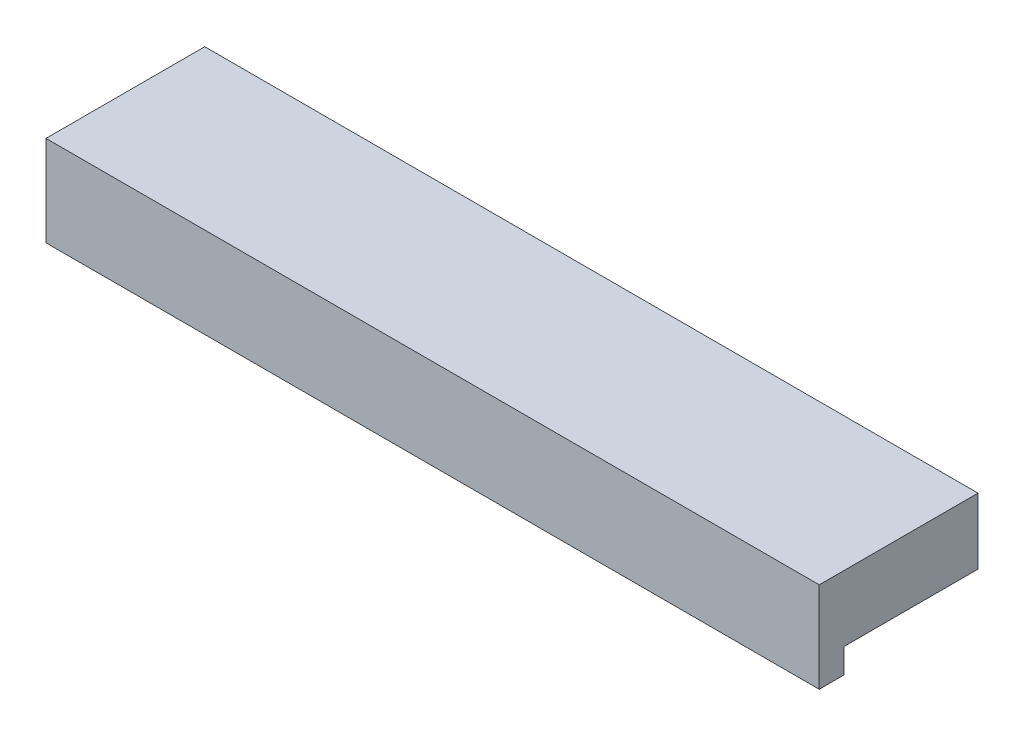
ISO-10303-21;
HEADER;
FILE_DESCRIPTION(('STEP AP214'),'2;1');
FILE_NAME('part.step','',(''),(''),'','','');
FILE_SCHEMA(('AUTOMOTIVE_DESIGN { 1 0 10303 214 1 1 1 1 }'));
ENDSEC;
DATA;
#1=APPLICATION_CONTEXT('core data for automotive mechanical design processes');
#2=APPLICATION_PROTOCOL_DEFINITION('international standard','automotive_design',2000,#1);
#3=PRODUCT_CONTEXT('',#1,'mechanical');
#4=PRODUCT('Part','Part','',(#3));
#5=PRODUCT_RELATED_PRODUCT_CATEGORY('part','',(#4));
#6=PRODUCT_DEFINITION_FORMATION('','',#4);
#7=PRODUCT_DEFINITION_CONTEXT('part definition',#1,'design');
#8=PRODUCT_DEFINITION('design','',#6,#7);
#9=PRODUCT_DEFINITION_SHAPE('','',#8);
#10=(LENGTH_UNIT() NAMED_UNIT(*) SI_UNIT(.MILLI.,.METRE.));
#11=(NAMED_UNIT(*) PLANE_ANGLE_UNIT() SI_UNIT($,.RADIAN.));
#12=(NAMED_UNIT(*) SI_UNIT($,.STERADIAN.) SOLID_ANGLE_UNIT());
#13=UNCERTAINTY_MEASURE_WITH_UNIT(LENGTH_MEASURE(1.E-05),#10,'distance_accuracy_value','');
#14=(GEOMETRIC_REPRESENTATION_CONTEXT(3) GLOBAL_UNCERTAINTY_ASSIGNED_CONTEXT((#13)) GLOBAL_UNIT_ASSIGNED_CONTEXT((#10,
#11,#12)) REPRESENTATION_CONTEXT('',''));
#15=CARTESIAN_POINT('',(0.,0.,0.));
#16=DIRECTION('',(0.,0.,1.));
#17=DIRECTION('',(1.,0.,0.));
#18=AXIS2_PLACEMENT_3D('',#15,#16,#17);
#19=CARTESIAN_POINT('',(-146.083399220501,-24.7311663924978,-18.5004782565443));
#20=DIRECTION('',(0.,-1.,0.));
#21=DIRECTION('',(1.,0.,0.));
#22=AXIS2_PLACEMENT_3D('',#19,#20,#21);
#23=PLANE('',#22);
#24=DIRECTION('',(-1.,0.,0.));
#25=VECTOR('',#24,1.);
#26=CARTESIAN_POINT('',(28.0832674461654,-24.7311663924978,-18.5004782565443));
#27=LINE('',#26,#25);
#28=CARTESIAN_POINT('',(10.5832674461654,-24.7311663924978,-18.5004782565443));
#29=VERTEX_POINT('',#28);
#30=CARTESIAN_POINT('',(-146.083399220501,-24.7311663924978,-18.5004782565443));
#31=VERTEX_POINT('',#30);
#32=EDGE_CURVE('E11',#29,#31,#27,.T.);
#33=ORIENTED_EDGE('',*,*,#32,.T.);
#34=DIRECTION('',(0.,0.,1.));
#35=VECTOR('',#34,1.);
#36=CARTESIAN_POINT('',(-146.083399220501,-24.7311663924978,4.33149354715814));
#37=LINE('',#36,#35);
#38=CARTESIAN_POINT('',(-146.083399220501,-24.7311663924978,13.6648268804915));
#39=VERTEX_POINT('',#38);
#40=EDGE_CURVE('E50',#31,#39,#37,.T.);
#41=ORIENTED_EDGE('',*,*,#40,.T.);
#42=DIRECTION('',(-1.,0.,0.));
#43=VECTOR('',#42,1.);
#44=CARTESIAN_POINT('',(45.1666007794988,-24.7311663924978,13.6648268804915));
#45=LINE('',#44,#43);
#46=CARTESIAN_POINT('',(10.5832674461654,-24.7311663924978,13.6648268804915));
#47=VERTEX_POINT('',#46);
#48=EDGE_CURVE('E136',#47,#39,#45,.T.);
#49=ORIENTED_EDGE('',*,*,#48,.F.);
#50=DIRECTION('',(0.,0.,-1.));
#51=VECTOR('',#50,1.);
#52=CARTESIAN_POINT('',(10.5832674461654,-24.7311663924978,4.33149354715814));
#53=LINE('',#52,#51);
#54=EDGE_CURVE('E45',#47,#29,#53,.T.);
#55=ORIENTED_EDGE('',*,*,#54,.T.);
#56=EDGE_LOOP('',(#33,#41,#49,#55));
#57=FACE_BOUND('',#56,.T.);
#58=ADVANCED_FACE('F42',(#57),#23,.F.);
#59=CARTESIAN_POINT('',(10.5832674461654,-43.0644997258311,4.33149354715814));
#60=DIRECTION('',(1.,0.,0.));
#61=DIRECTION('',(0.,-1.,0.));
#62=AXIS2_PLACEMENT_3D('',#59,#60,#61);
#63=PLANE('',#62);
#64=ORIENTED_EDGE('',*,*,#54,.F.);
#65=DIRECTION('',(0.,1.,0.));
#66=VECTOR('',#65,1.);
#67=CARTESIAN_POINT('',(10.5832674461654,-43.0644997258311,13.6648268804915));
#68=LINE('',#67,#66);
#69=CARTESIAN_POINT('',(10.5832674461654,-43.0644997258311,13.6648268804915));
#70=VERTEX_POINT('',#69);
#71=EDGE_CURVE('E122',#70,#47,#68,.T.);
#72=ORIENTED_EDGE('',*,*,#71,.F.);
#73=DIRECTION('',(0.,0.,-1.));
#74=VECTOR('',#73,1.);
#75=CARTESIAN_POINT('',(10.5832674461654,-43.0644997258312,12.6648268804915));
#76=LINE('',#75,#74);
#77=CARTESIAN_POINT('',(10.5832674461654,-43.0644997258311,8.66482688049147));
#78=VERTEX_POINT('',#77);
#79=EDGE_CURVE('E113',#70,#78,#76,.T.);
#80=ORIENTED_EDGE('',*,*,#79,.T.);
#81=DIRECTION('',(0.,-1.,0.));
#82=VECTOR('',#81,1.);
#83=CARTESIAN_POINT('',(10.5832674461654,-43.0644997258311,8.66482688049147));
#84=LINE('',#83,#82);
#85=CARTESIAN_POINT('',(10.5832674461654,-38.0644997258311,8.66482688049147));
#86=VERTEX_POINT('',#85);
#87=EDGE_CURVE('E117',#86,#78,#84,.T.);
#88=ORIENTED_EDGE('',*,*,#87,.F.);
#89=DIRECTION('',(0.,0.,1.));
#90=VECTOR('',#89,1.);
#91=CARTESIAN_POINT('',(10.5832674461654,-38.0644997258311,8.66482688049147));
#92=LINE('',#91,#90);
#93=CARTESIAN_POINT('',(10.5832674461654,-38.0644997258312,-18.5004782565443));
#94=VERTEX_POINT('',#93);
#95=EDGE_CURVE('E100',#94,#86,#92,.T.);
#96=ORIENTED_EDGE('',*,*,#95,.F.);
#97=DIRECTION('',(0.,1.,0.));
#98=VECTOR('',#97,1.);
#99=CARTESIAN_POINT('',(10.5832674461654,-43.0644997258313,-18.5004782565443));
#100=LINE('',#99,#98);
#101=EDGE_CURVE('E110',#94,#29,#100,.T.);
#102=ORIENTED_EDGE('',*,*,#101,.T.);
#103=EDGE_LOOP('',(#64,#72,#80,#88,#96,#102));
#104=FACE_BOUND('',#103,.T.);
#105=ADVANCED_FACE('F115',(#104),#63,.T.);
#106=CARTESIAN_POINT('',(45.1666007794988,-43.0644997258311,13.6648268804915));
#107=DIRECTION('',(0.,0.,-1.));
#108=DIRECTION('',(0.,-1.,0.));
#109=AXIS2_PLACEMENT_3D('',#106,#107,#108);
#110=PLANE('',#109);
#111=ORIENTED_EDGE('',*,*,#71,.T.);
#112=ORIENTED_EDGE('',*,*,#48,.T.);
#113=DIRECTION('',(0.,-1.,0.));
#114=VECTOR('',#113,1.);
#115=CARTESIAN_POINT('',(-146.083399220501,-43.0644997258312,13.6648268804915));
#116=LINE('',#115,#114);
#117=CARTESIAN_POINT('',(-146.083399220501,-43.0644997258311,13.6648268804915));
#118=VERTEX_POINT('',#117);
#119=EDGE_CURVE('E106',#39,#118,#116,.T.);
#120=ORIENTED_EDGE('',*,*,#119,.T.);
#121=DIRECTION('',(1.,0.,0.));
#122=VECTOR('',#121,1.);
#123=CARTESIAN_POINT('',(40.1666007794988,-43.0644997258311,13.6648268804915));
#124=LINE('',#123,#122);
#125=EDGE_CURVE('E120',#118,#70,#124,.T.);
#126=ORIENTED_EDGE('',*,*,#125,.T.);
#127=EDGE_LOOP('',(#111,#112,#120,#126));
#128=FACE_BOUND('',#127,.T.);
#129=ADVANCED_FACE('F142',(#128),#110,.F.);
#130=CARTESIAN_POINT('',(45.1666007794988,-43.0644997258311,12.6648268804915));
#131=DIRECTION('',(0.,-1.,0.));
#132=DIRECTION('',(0.,0.,-1.));
#133=AXIS2_PLACEMENT_3D('',#130,#131,#132);
#134=PLANE('',#133);
#135=DIRECTION('',(0.,0.,1.));
#136=VECTOR('',#135,1.);
#137=CARTESIAN_POINT('',(-146.083399220501,-43.0644997258312,12.6648268804915));
#138=LINE('',#137,#136);
#139=CARTESIAN_POINT('',(-146.083399220501,-43.0644997258311,8.66482688049147));
#140=VERTEX_POINT('',#139);
#141=EDGE_CURVE('E133',#140,#118,#138,.T.);
#142=ORIENTED_EDGE('',*,*,#141,.F.);
#143=DIRECTION('',(-1.,0.,0.));
#144=VECTOR('',#143,1.);
#145=CARTESIAN_POINT('',(40.1666007794988,-43.0644997258311,8.66482688049147));
#146=LINE('',#145,#144);
#147=EDGE_CURVE('E107',#78,#140,#146,.T.);
#148=ORIENTED_EDGE('',*,*,#147,.F.);
#149=ORIENTED_EDGE('',*,*,#79,.F.);
#150=ORIENTED_EDGE('',*,*,#125,.F.);
#151=EDGE_LOOP('',(#142,#148,#149,#150));
#152=FACE_BOUND('',#151,.T.);
#153=ADVANCED_FACE('F150',(#152),#134,.T.);
#154=CARTESIAN_POINT('',(45.1666007794988,-43.0644997258311,8.66482688049147));
#155=DIRECTION('',(0.,0.,1.));
#156=DIRECTION('',(1.,0.,0.));
#157=AXIS2_PLACEMENT_3D('',#154,#155,#156);
#158=PLANE('',#157);
#159=ORIENTED_EDGE('',*,*,#147,.T.);
#160=DIRECTION('',(0.,1.,0.));
#161=VECTOR('',#160,1.);
#162=CARTESIAN_POINT('',(-146.083399220501,-43.0644997258312,8.66482688049147));
#163=LINE('',#162,#161);
#164=CARTESIAN_POINT('',(-146.083399220501,-38.0644997258311,8.66482688049147));
#165=VERTEX_POINT('',#164);
#166=EDGE_CURVE('E132',#140,#165,#163,.T.);
#167=ORIENTED_EDGE('',*,*,#166,.T.);
#168=DIRECTION('',(1.,0.,0.));
#169=VECTOR('',#168,1.);
#170=CARTESIAN_POINT('',(40.1666007794988,-38.0644997258311,8.66482688049147));
#171=LINE('',#170,#169);
#172=EDGE_CURVE('E118',#165,#86,#171,.T.);
#173=ORIENTED_EDGE('',*,*,#172,.T.);
#174=ORIENTED_EDGE('',*,*,#87,.T.);
#175=EDGE_LOOP('',(#159,#167,#173,#174));
#176=FACE_BOUND('',#175,.T.);
#177=ADVANCED_FACE('F152',(#176),#158,.F.);
#178=CARTESIAN_POINT('',(40.1666007794988,-38.0644997258311,8.66482688049147));
#179=DIRECTION('',(0.,1.,0.));
#180=DIRECTION('',(1.,0.,0.));
#181=AXIS2_PLACEMENT_3D('',#178,#179,#180);
#182=PLANE('',#181);
#183=ORIENTED_EDGE('',*,*,#172,.F.);
#184=DIRECTION('',(0.,0.,-1.));
#185=VECTOR('',#184,1.);
#186=CARTESIAN_POINT('',(-146.083399220501,-38.0644997258311,8.66482688049147));
#187=LINE('',#186,#185);
#188=CARTESIAN_POINT('',(-146.083399220501,-38.0644997258315,-18.5004782565443));
#189=VERTEX_POINT('',#188);
#190=EDGE_CURVE('E103',#165,#189,#187,.T.);
#191=ORIENTED_EDGE('',*,*,#190,.T.);
#192=DIRECTION('',(1.,0.,0.));
#193=VECTOR('',#192,1.);
#194=CARTESIAN_POINT('',(-67.7500658871679,-38.0644997258313,-18.5004782565443));
#195=LINE('',#194,#193);
#196=EDGE_CURVE('E95',#189,#94,#195,.T.);
#197=ORIENTED_EDGE('',*,*,#196,.T.);
#198=ORIENTED_EDGE('',*,*,#95,.T.);
#199=EDGE_LOOP('',(#183,#191,#197,#198));
#200=FACE_BOUND('',#199,.T.);
#201=ADVANCED_FACE('F98',(#200),#182,.F.);
#202=CARTESIAN_POINT('',(-67.7500658871679,-43.0644997258313,-18.5004782565443));
#203=DIRECTION('',(0.,0.,-1.));
#204=DIRECTION('',(0.,-1.,0.));
#205=AXIS2_PLACEMENT_3D('',#202,#203,#204);
#206=PLANE('',#205);
#207=DIRECTION('',(0.,-1.,0.));
#208=VECTOR('',#207,1.);
#209=CARTESIAN_POINT('',(-146.083399220501,-43.0644997258313,-18.5004782565443));
#210=LINE('',#209,#208);
#211=EDGE_CURVE('E137',#31,#189,#210,.T.);
#212=ORIENTED_EDGE('',*,*,#211,.F.);
#213=ORIENTED_EDGE('',*,*,#32,.F.);
#214=ORIENTED_EDGE('',*,*,#101,.F.);
#215=ORIENTED_EDGE('',*,*,#196,.F.);
#216=EDGE_LOOP('',(#212,#213,#214,#215));
#217=FACE_BOUND('',#216,.T.);
#218=ADVANCED_FACE('F111',(#217),#206,.T.);
#219=CARTESIAN_POINT('',(-146.083399220501,-43.0644997258311,4.33149354715814));
#220=DIRECTION('',(-1.,0.,0.));
#221=DIRECTION('',(0.,1.,0.));
#222=AXIS2_PLACEMENT_3D('',#219,#220,#221);
#223=PLANE('',#222);
#224=ORIENTED_EDGE('',*,*,#40,.F.);
#225=ORIENTED_EDGE('',*,*,#211,.T.);
#226=ORIENTED_EDGE('',*,*,#190,.F.);
#227=ORIENTED_EDGE('',*,*,#166,.F.);
#228=ORIENTED_EDGE('',*,*,#141,.T.);
#229=ORIENTED_EDGE('',*,*,#119,.F.);
#230=EDGE_LOOP('',(#224,#225,#226,#227,#228,#229));
#231=FACE_BOUND('',#230,.T.);
#232=ADVANCED_FACE('F144',(#231),#223,.T.);
#233=CLOSED_SHELL('',(#58,#105,#129,#153,#177,#201,#218,#232));
#234=MANIFOLD_SOLID_BREP('B2',#233);
#235=ADVANCED_BREP_SHAPE_REPRESENTATION('',(#18,#234),#14);
#236=SHAPE_DEFINITION_REPRESENTATION(#9,#235);
ENDSEC;
END-ISO-10303-21;
